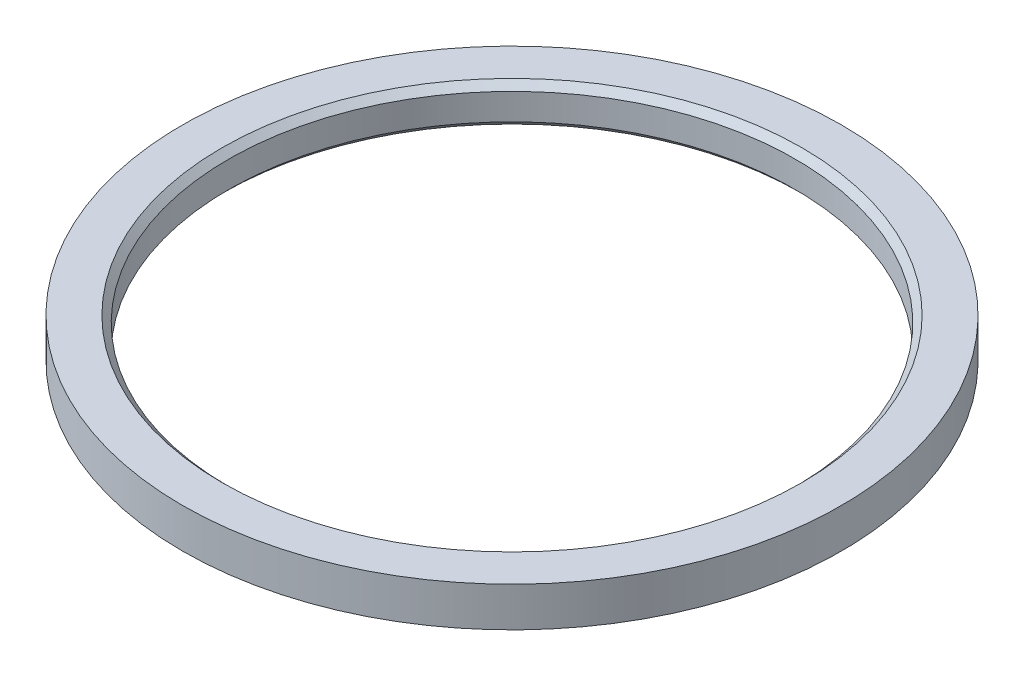
ISO-10303-21;
HEADER;
FILE_DESCRIPTION(('STEP AP214'),'2;1');
FILE_NAME('part.step','',(''),(''),'','','');
FILE_SCHEMA(('AUTOMOTIVE_DESIGN { 1 0 10303 214 1 1 1 1 }'));
ENDSEC;
DATA;
#1=APPLICATION_CONTEXT('core data for automotive mechanical design processes');
#2=APPLICATION_PROTOCOL_DEFINITION('international standard','automotive_design',2000,#1);
#3=PRODUCT_CONTEXT('',#1,'mechanical');
#4=PRODUCT('Part','Part','',(#3));
#5=PRODUCT_RELATED_PRODUCT_CATEGORY('part','',(#4));
#6=PRODUCT_DEFINITION_FORMATION('','',#4);
#7=PRODUCT_DEFINITION_CONTEXT('part definition',#1,'design');
#8=PRODUCT_DEFINITION('design','',#6,#7);
#9=PRODUCT_DEFINITION_SHAPE('','',#8);
#10=(LENGTH_UNIT() NAMED_UNIT(*) SI_UNIT(.MILLI.,.METRE.));
#11=(NAMED_UNIT(*) PLANE_ANGLE_UNIT() SI_UNIT($,.RADIAN.));
#12=(NAMED_UNIT(*) SI_UNIT($,.STERADIAN.) SOLID_ANGLE_UNIT());
#13=UNCERTAINTY_MEASURE_WITH_UNIT(LENGTH_MEASURE(1.E-05),#10,'distance_accuracy_value','');
#14=(GEOMETRIC_REPRESENTATION_CONTEXT(3) GLOBAL_UNCERTAINTY_ASSIGNED_CONTEXT((#13)) GLOBAL_UNIT_ASSIGNED_CONTEXT((#10,
#11,#12)) REPRESENTATION_CONTEXT('',''));
#15=CARTESIAN_POINT('',(0.,0.,0.));
#16=DIRECTION('',(0.,0.,1.));
#17=DIRECTION('',(1.,0.,0.));
#18=AXIS2_PLACEMENT_3D('',#15,#16,#17);
#19=CARTESIAN_POINT('',(0.,1.2,0.));
#20=DIRECTION('',(0.,1.,0.));
#21=DIRECTION('',(0.,0.,1.));
#22=AXIS2_PLACEMENT_3D('',#19,#20,#21);
#23=PLANE('',#22);
#24=CARTESIAN_POINT('',(0.,1.2,0.));
#25=DIRECTION('',(0.,1.,0.));
#26=DIRECTION('',(0.,0.,1.));
#27=AXIS2_PLACEMENT_3D('',#24,#25,#26);
#28=CIRCLE('',#27,8.8);
#29=CARTESIAN_POINT('',(0.,1.2,8.8));
#30=VERTEX_POINT('',#29);
#31=EDGE_CURVE('E10',#30,#30,#28,.F.);
#32=ORIENTED_EDGE('',*,*,#31,.T.);
#33=EDGE_LOOP('',(#32));
#34=FACE_BOUND('',#33,.T.);
#35=CARTESIAN_POINT('',(0.,1.2,0.));
#36=DIRECTION('',(0.,1.,0.));
#37=DIRECTION('',(0.,0.,1.));
#38=AXIS2_PLACEMENT_3D('',#35,#36,#37);
#39=CIRCLE('',#38,10.);
#40=CARTESIAN_POINT('',(0.,1.2,10.));
#41=VERTEX_POINT('',#40);
#42=EDGE_CURVE('E54',#41,#41,#39,.T.);
#43=ORIENTED_EDGE('',*,*,#42,.T.);
#44=EDGE_LOOP('',(#43));
#45=FACE_BOUND('',#44,.T.);
#46=ADVANCED_FACE('F33',(#34,#45),#23,.T.);
#47=CARTESIAN_POINT('',(0.,0.,0.));
#48=DIRECTION('',(0.,1.,0.));
#49=DIRECTION('',(0.,0.,1.));
#50=AXIS2_PLACEMENT_3D('',#47,#48,#49);
#51=PLANE('',#50);
#52=CARTESIAN_POINT('',(0.,0.,0.));
#53=DIRECTION('',(0.,1.,0.));
#54=DIRECTION('',(0.,0.,1.));
#55=AXIS2_PLACEMENT_3D('',#52,#53,#54);
#56=CIRCLE('',#55,8.8);
#57=CARTESIAN_POINT('',(0.,0.,8.8));
#58=VERTEX_POINT('',#57);
#59=EDGE_CURVE('E49',#58,#58,#56,.T.);
#60=ORIENTED_EDGE('',*,*,#59,.T.);
#61=EDGE_LOOP('',(#60));
#62=FACE_BOUND('',#61,.T.);
#63=CARTESIAN_POINT('',(0.,0.,0.));
#64=DIRECTION('',(0.,1.,0.));
#65=DIRECTION('',(0.,0.,1.));
#66=AXIS2_PLACEMENT_3D('',#63,#64,#65);
#67=CIRCLE('',#66,10.);
#68=CARTESIAN_POINT('',(0.,0.,10.));
#69=VERTEX_POINT('',#68);
#70=EDGE_CURVE('E55',#69,#69,#67,.T.);
#71=ORIENTED_EDGE('',*,*,#70,.F.);
#72=EDGE_LOOP('',(#71));
#73=FACE_BOUND('',#72,.T.);
#74=ADVANCED_FACE('F66',(#62,#73),#51,.F.);
#75=CARTESIAN_POINT('',(0.,1.2,0.));
#76=DIRECTION('',(0.,-1.,0.));
#77=DIRECTION('',(0.,0.,-1.));
#78=AXIS2_PLACEMENT_3D('',#75,#76,#77);
#79=CYLINDRICAL_SURFACE('',#78,10.);
#80=ORIENTED_EDGE('',*,*,#42,.F.);
#81=EDGE_LOOP('',(#80));
#82=FACE_BOUND('',#81,.T.);
#83=ORIENTED_EDGE('',*,*,#70,.T.);
#84=EDGE_LOOP('',(#83));
#85=FACE_BOUND('',#84,.T.);
#86=ADVANCED_FACE('F62',(#82,#85),#79,.T.);
#87=CARTESIAN_POINT('',(0.,1.2,0.));
#88=DIRECTION('',(0.,-1.,0.));
#89=DIRECTION('',(0.,0.,-1.));
#90=AXIS2_PLACEMENT_3D('',#87,#88,#89);
#91=CYLINDRICAL_SURFACE('',#90,8.6);
#92=CARTESIAN_POINT('',(0.,0.200000000000001,0.));
#93=DIRECTION('',(0.,1.,0.));
#94=DIRECTION('',(0.,0.,1.));
#95=AXIS2_PLACEMENT_3D('',#92,#93,#94);
#96=CIRCLE('',#95,8.6);
#97=CARTESIAN_POINT('',(0.,0.200000000000001,8.6));
#98=VERTEX_POINT('',#97);
#99=EDGE_CURVE('E41',#98,#98,#96,.F.);
#100=ORIENTED_EDGE('',*,*,#99,.T.);
#101=EDGE_LOOP('',(#100));
#102=FACE_BOUND('',#101,.T.);
#103=CARTESIAN_POINT('',(0.,1.,0.));
#104=DIRECTION('',(0.,1.,0.));
#105=DIRECTION('',(0.,0.,1.));
#106=AXIS2_PLACEMENT_3D('',#103,#104,#105);
#107=CIRCLE('',#106,8.6);
#108=CARTESIAN_POINT('',(0.,1.,8.6));
#109=VERTEX_POINT('',#108);
#110=EDGE_CURVE('E45',#109,#109,#107,.T.);
#111=ORIENTED_EDGE('',*,*,#110,.T.);
#112=EDGE_LOOP('',(#111));
#113=FACE_BOUND('',#112,.T.);
#114=ADVANCED_FACE('F65',(#102,#113),#91,.F.);
#115=CARTESIAN_POINT('',(0.,0.,0.));
#116=DIRECTION('',(0.,-1.,0.));
#117=DIRECTION('',(0.,0.,-1.));
#118=AXIS2_PLACEMENT_3D('',#115,#116,#117);
#119=CONICAL_SURFACE('',#118,8.8,0.785398163397448);
#120=ORIENTED_EDGE('',*,*,#99,.F.);
#121=EDGE_LOOP('',(#120));
#122=FACE_BOUND('',#121,.T.);
#123=ORIENTED_EDGE('',*,*,#59,.F.);
#124=EDGE_LOOP('',(#123));
#125=FACE_BOUND('',#124,.T.);
#126=ADVANCED_FACE('F80',(#122,#125),#119,.F.);
#127=CARTESIAN_POINT('',(0.,1.,0.));
#128=DIRECTION('',(0.,1.,0.));
#129=DIRECTION('',(0.,0.,1.));
#130=AXIS2_PLACEMENT_3D('',#127,#128,#129);
#131=CONICAL_SURFACE('',#130,8.6,0.785398163397448);
#132=ORIENTED_EDGE('',*,*,#31,.F.);
#133=EDGE_LOOP('',(#132));
#134=FACE_BOUND('',#133,.T.);
#135=ORIENTED_EDGE('',*,*,#110,.F.);
#136=EDGE_LOOP('',(#135));
#137=FACE_BOUND('',#136,.T.);
#138=ADVANCED_FACE('F36',(#134,#137),#131,.F.);
#139=CLOSED_SHELL('',(#46,#74,#86,#114,#126,#138));
#140=MANIFOLD_SOLID_BREP('B2',#139);
#141=ADVANCED_BREP_SHAPE_REPRESENTATION('',(#18,#140),#14);
#142=SHAPE_DEFINITION_REPRESENTATION(#9,#141);
ENDSEC;
END-ISO-10303-21;
